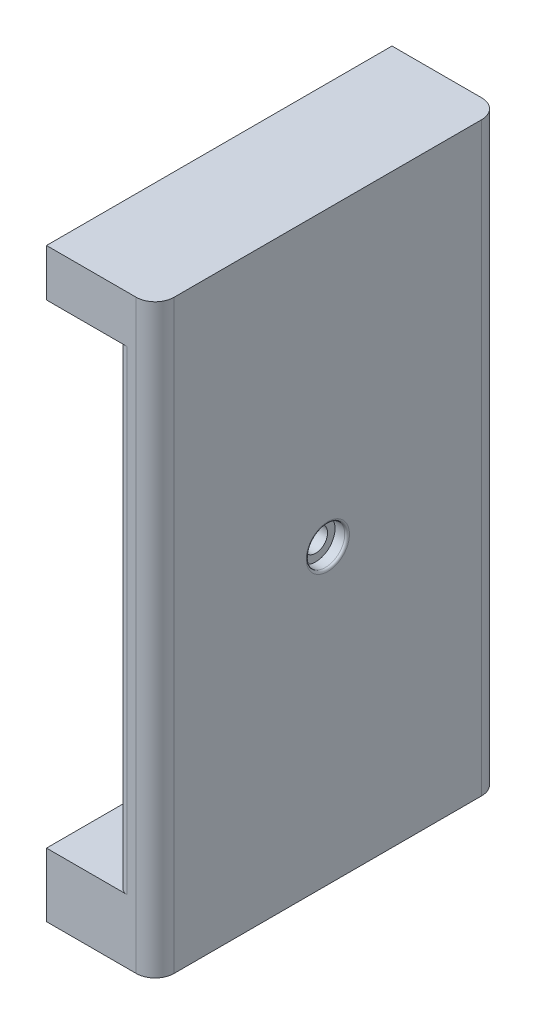
ISO-10303-21;
HEADER;
FILE_DESCRIPTION(('STEP AP214'),'2;1');
FILE_NAME('part.step','',(''),(''),'','','');
FILE_SCHEMA(('AUTOMOTIVE_DESIGN { 1 0 10303 214 1 1 1 1 }'));
ENDSEC;
DATA;
#1=APPLICATION_CONTEXT('core data for automotive mechanical design processes');
#2=APPLICATION_PROTOCOL_DEFINITION('international standard','automotive_design',2000,#1);
#3=PRODUCT_CONTEXT('',#1,'mechanical');
#4=PRODUCT('Part','Part','',(#3));
#5=PRODUCT_RELATED_PRODUCT_CATEGORY('part','',(#4));
#6=PRODUCT_DEFINITION_FORMATION('','',#4);
#7=PRODUCT_DEFINITION_CONTEXT('part definition',#1,'design');
#8=PRODUCT_DEFINITION('design','',#6,#7);
#9=PRODUCT_DEFINITION_SHAPE('','',#8);
#10=(LENGTH_UNIT() NAMED_UNIT(*) SI_UNIT(.MILLI.,.METRE.));
#11=(NAMED_UNIT(*) PLANE_ANGLE_UNIT() SI_UNIT($,.RADIAN.));
#12=(NAMED_UNIT(*) SI_UNIT($,.STERADIAN.) SOLID_ANGLE_UNIT());
#13=UNCERTAINTY_MEASURE_WITH_UNIT(LENGTH_MEASURE(1.E-05),#10,'distance_accuracy_value','');
#14=(GEOMETRIC_REPRESENTATION_CONTEXT(3) GLOBAL_UNCERTAINTY_ASSIGNED_CONTEXT((#13)) GLOBAL_UNIT_ASSIGNED_CONTEXT((#10,
#11,#12)) REPRESENTATION_CONTEXT('',''));
#15=CARTESIAN_POINT('',(0.,0.,0.));
#16=DIRECTION('',(0.,0.,1.));
#17=DIRECTION('',(1.,0.,0.));
#18=AXIS2_PLACEMENT_3D('',#15,#16,#17);
#19=CARTESIAN_POINT('',(20.255,0.,0.));
#20=DIRECTION('',(1.,0.,0.));
#21=DIRECTION('',(0.,1.,0.));
#22=AXIS2_PLACEMENT_3D('',#19,#20,#21);
#23=PLANE('',#22);
#24=CARTESIAN_POINT('',(20.255,0.,0.));
#25=DIRECTION('',(1.,0.,0.));
#26=DIRECTION('',(0.,1.,0.));
#27=AXIS2_PLACEMENT_3D('',#24,#25,#26);
#28=CIRCLE('',#27,20.25);
#29=CARTESIAN_POINT('',(20.255,20.25,0.));
#30=VERTEX_POINT('',#29);
#31=EDGE_CURVE('E226',#30,#30,#28,.T.);
#32=ORIENTED_EDGE('',*,*,#31,.T.);
#33=EDGE_LOOP('',(#32));
#34=FACE_BOUND('',#33,.T.);
#35=DIRECTION('',(0.,0.,1.));
#36=VECTOR('',#35,1.);
#37=CARTESIAN_POINT('',(20.255,52.,-36.576));
#38=LINE('',#37,#36);
#39=CARTESIAN_POINT('',(20.255,52.,-34.576));
#40=VERTEX_POINT('',#39);
#41=CARTESIAN_POINT('',(20.255,52.,34.576));
#42=VERTEX_POINT('',#41);
#43=EDGE_CURVE('E151',#40,#42,#38,.T.);
#44=ORIENTED_EDGE('',*,*,#43,.F.);
#45=DIRECTION('',(0.,1.,0.));
#46=VECTOR('',#45,1.);
#47=CARTESIAN_POINT('',(20.255,0.,-34.576));
#48=LINE('',#47,#46);
#49=CARTESIAN_POINT('',(20.255,-48.5,-34.576));
#50=VERTEX_POINT('',#49);
#51=EDGE_CURVE('E229',#40,#50,#48,.F.);
#52=ORIENTED_EDGE('',*,*,#51,.T.);
#53=DIRECTION('',(0.,0.,-1.));
#54=VECTOR('',#53,1.);
#55=CARTESIAN_POINT('',(20.255,-48.5,-36.576));
#56=LINE('',#55,#54);
#57=CARTESIAN_POINT('',(20.255,-48.5,34.576));
#58=VERTEX_POINT('',#57);
#59=EDGE_CURVE('E157',#58,#50,#56,.T.);
#60=ORIENTED_EDGE('',*,*,#59,.F.);
#61=DIRECTION('',(0.,1.,0.));
#62=VECTOR('',#61,1.);
#63=CARTESIAN_POINT('',(20.255,52.,34.576));
#64=LINE('',#63,#62);
#65=EDGE_CURVE('E223',#58,#42,#64,.T.);
#66=ORIENTED_EDGE('',*,*,#65,.T.);
#67=EDGE_LOOP('',(#44,#52,#60,#66));
#68=FACE_BOUND('',#67,.T.);
#69=ADVANCED_FACE('F45',(#34,#68),#23,.F.);
#70=CARTESIAN_POINT('',(8.25500000000001,0.,0.));
#71=DIRECTION('',(1.,0.,0.));
#72=DIRECTION('',(0.,1.,0.));
#73=AXIS2_PLACEMENT_3D('',#70,#71,#72);
#74=PLANE('',#73);
#75=CARTESIAN_POINT('',(8.25500000000001,0.,0.));
#76=DIRECTION('',(-1.,0.,0.));
#77=DIRECTION('',(0.,-1.,0.));
#78=AXIS2_PLACEMENT_3D('',#75,#76,#77);
#79=CIRCLE('',#78,13.15);
#80=CARTESIAN_POINT('',(8.25500000000001,-13.15,0.));
#81=VERTEX_POINT('',#80);
#82=EDGE_CURVE('E213',#81,#81,#79,.T.);
#83=ORIENTED_EDGE('',*,*,#82,.F.);
#84=EDGE_LOOP('',(#83));
#85=FACE_BOUND('',#84,.T.);
#86=CARTESIAN_POINT('',(8.25500000000001,0.,0.));
#87=DIRECTION('',(-1.,0.,0.));
#88=DIRECTION('',(0.,-1.,0.));
#89=AXIS2_PLACEMENT_3D('',#86,#87,#88);
#90=CIRCLE('',#89,18.25);
#91=CARTESIAN_POINT('',(8.25500000000002,-18.25,0.));
#92=VERTEX_POINT('',#91);
#93=EDGE_CURVE('E217',#92,#92,#90,.T.);
#94=ORIENTED_EDGE('',*,*,#93,.T.);
#95=EDGE_LOOP('',(#94));
#96=FACE_BOUND('',#95,.T.);
#97=ADVANCED_FACE('F335',(#85,#96),#74,.F.);
#98=CARTESIAN_POINT('',(8.255,0.,0.));
#99=DIRECTION('',(-1.,0.,0.));
#100=DIRECTION('',(0.,-1.,0.));
#101=AXIS2_PLACEMENT_3D('',#98,#99,#100);
#102=CYLINDRICAL_SURFACE('',#101,18.25);
#103=CARTESIAN_POINT('',(18.255,0.,0.));
#104=DIRECTION('',(1.,0.,0.));
#105=DIRECTION('',(0.,1.,0.));
#106=AXIS2_PLACEMENT_3D('',#103,#104,#105);
#107=CIRCLE('',#106,18.25);
#108=CARTESIAN_POINT('',(18.255,18.25,0.));
#109=VERTEX_POINT('',#108);
#110=EDGE_CURVE('E231',#109,#109,#107,.F.);
#111=ORIENTED_EDGE('',*,*,#110,.T.);
#112=EDGE_LOOP('',(#111));
#113=FACE_BOUND('',#112,.T.);
#114=ORIENTED_EDGE('',*,*,#93,.F.);
#115=EDGE_LOOP('',(#114));
#116=FACE_BOUND('',#115,.T.);
#117=ADVANCED_FACE('F342',(#113,#116),#102,.T.);
#118=CARTESIAN_POINT('',(20.255,0.,0.));
#119=DIRECTION('',(-1.,0.,0.));
#120=DIRECTION('',(0.,-1.,0.));
#121=AXIS2_PLACEMENT_3D('',#118,#119,#120);
#122=CYLINDRICAL_SURFACE('',#121,13.15);
#123=CARTESIAN_POINT('',(20.255,0.,0.));
#124=DIRECTION('',(-1.,0.,0.));
#125=DIRECTION('',(0.,-1.,0.));
#126=AXIS2_PLACEMENT_3D('',#123,#124,#125);
#127=CIRCLE('',#126,13.15);
#128=CARTESIAN_POINT('',(20.255,-13.15,0.));
#129=VERTEX_POINT('',#128);
#130=EDGE_CURVE('E214',#129,#129,#127,.T.);
#131=ORIENTED_EDGE('',*,*,#130,.F.);
#132=EDGE_LOOP('',(#131));
#133=FACE_BOUND('',#132,.T.);
#134=ORIENTED_EDGE('',*,*,#82,.T.);
#135=EDGE_LOOP('',(#134));
#136=FACE_BOUND('',#135,.T.);
#137=ADVANCED_FACE('F348',(#133,#136),#122,.F.);
#138=CARTESIAN_POINT('',(20.255,0.,0.));
#139=DIRECTION('',(1.,0.,0.));
#140=DIRECTION('',(0.,1.,0.));
#141=AXIS2_PLACEMENT_3D('',#138,#139,#140);
#142=CIRCLE('',#141,2.5);
#143=CARTESIAN_POINT('',(20.255,2.50000000000001,0.));
#144=VERTEX_POINT('',#143);
#145=EDGE_CURVE('E207',#144,#144,#142,.F.);
#146=ORIENTED_EDGE('',*,*,#145,.F.);
#147=EDGE_LOOP('',(#146));
#148=FACE_BOUND('',#147,.T.);
#149=ORIENTED_EDGE('',*,*,#130,.T.);
#150=EDGE_LOOP('',(#149));
#151=FACE_BOUND('',#150,.T.);
#152=ADVANCED_FACE('F338',(#148,#151),#23,.F.);
#153=CARTESIAN_POINT('',(28.255,0.,36.576));
#154=DIRECTION('',(0.,0.,1.));
#155=DIRECTION('',(1.,0.,0.));
#156=AXIS2_PLACEMENT_3D('',#153,#154,#155);
#157=PLANE('',#156);
#158=DIRECTION('',(1.,0.,0.));
#159=VECTOR('',#158,1.);
#160=CARTESIAN_POINT('',(5.25499999999997,52.,36.576));
#161=LINE('',#160,#159);
#162=CARTESIAN_POINT('',(5.25499999999997,52.,36.576));
#163=VERTEX_POINT('',#162);
#164=CARTESIAN_POINT('',(22.255,52.,36.576));
#165=VERTEX_POINT('',#164);
#166=EDGE_CURVE('E60',#163,#165,#161,.T.);
#167=ORIENTED_EDGE('',*,*,#166,.T.);
#168=DIRECTION('',(0.,1.,0.));
#169=VECTOR('',#168,1.);
#170=CARTESIAN_POINT('',(22.255,-48.5,36.576));
#171=LINE('',#170,#169);
#172=CARTESIAN_POINT('',(22.255,-48.5,36.576));
#173=VERTEX_POINT('',#172);
#174=EDGE_CURVE('E234',#165,#173,#171,.F.);
#175=ORIENTED_EDGE('',*,*,#174,.T.);
#176=DIRECTION('',(1.,0.,0.));
#177=VECTOR('',#176,1.);
#178=CARTESIAN_POINT('',(5.25500000000004,-48.5,36.576));
#179=LINE('',#178,#177);
#180=CARTESIAN_POINT('',(5.25500000000004,-48.5,36.576));
#181=VERTEX_POINT('',#180);
#182=EDGE_CURVE('E67',#181,#173,#179,.T.);
#183=ORIENTED_EDGE('',*,*,#182,.F.);
#184=DIRECTION('',(0.,1.,0.));
#185=VECTOR('',#184,1.);
#186=CARTESIAN_POINT('',(5.25500000000004,-48.5,36.576));
#187=LINE('',#186,#185);
#188=CARTESIAN_POINT('',(5.25500000000005,-62.,36.576));
#189=VERTEX_POINT('',#188);
#190=EDGE_CURVE('E171',#189,#181,#187,.T.);
#191=ORIENTED_EDGE('',*,*,#190,.F.);
#192=DIRECTION('',(-1.,0.,0.));
#193=VECTOR('',#192,1.);
#194=CARTESIAN_POINT('',(28.255,-62.,36.576));
#195=LINE('',#194,#193);
#196=CARTESIAN_POINT('',(24.255,-62.,36.576));
#197=VERTEX_POINT('',#196);
#198=EDGE_CURVE('E180',#197,#189,#195,.T.);
#199=ORIENTED_EDGE('',*,*,#198,.F.);
#200=DIRECTION('',(0.,1.,0.));
#201=VECTOR('',#200,1.);
#202=CARTESIAN_POINT('',(24.255,0.,36.576));
#203=LINE('',#202,#201);
#204=CARTESIAN_POINT('',(24.255,62.,36.576));
#205=VERTEX_POINT('',#204);
#206=EDGE_CURVE('E184',#197,#205,#203,.T.);
#207=ORIENTED_EDGE('',*,*,#206,.T.);
#208=DIRECTION('',(-1.,0.,0.));
#209=VECTOR('',#208,1.);
#210=CARTESIAN_POINT('',(28.255,62.,36.576));
#211=LINE('',#210,#209);
#212=CARTESIAN_POINT('',(5.25499999999996,62.,36.576));
#213=VERTEX_POINT('',#212);
#214=EDGE_CURVE('E267',#205,#213,#211,.T.);
#215=ORIENTED_EDGE('',*,*,#214,.T.);
#216=DIRECTION('',(0.,1.,0.));
#217=VECTOR('',#216,1.);
#218=CARTESIAN_POINT('',(5.25499999999996,62.,36.576));
#219=LINE('',#218,#217);
#220=EDGE_CURVE('E141',#163,#213,#219,.T.);
#221=ORIENTED_EDGE('',*,*,#220,.F.);
#222=EDGE_LOOP('',(#167,#175,#183,#191,#199,#207,#215,#221));
#223=FACE_BOUND('',#222,.T.);
#224=ADVANCED_FACE('F246',(#223),#157,.T.);
#225=CARTESIAN_POINT('',(28.255,-62.,0.));
#226=DIRECTION('',(0.,-1.,0.));
#227=DIRECTION('',(1.,0.,0.));
#228=AXIS2_PLACEMENT_3D('',#225,#226,#227);
#229=PLANE('',#228);
#230=CARTESIAN_POINT('',(18.5200000000001,-62.,12.75));
#231=DIRECTION('',(0.,-1.,0.));
#232=DIRECTION('',(1.,0.,0.));
#233=AXIS2_PLACEMENT_3D('',#230,#231,#232);
#234=CIRCLE('',#233,3.71375);
#235=CARTESIAN_POINT('',(22.2337500000001,-62.,12.75));
#236=VERTEX_POINT('',#235);
#237=EDGE_CURVE('E298',#236,#236,#234,.T.);
#238=ORIENTED_EDGE('',*,*,#237,.F.);
#239=EDGE_LOOP('',(#238));
#240=FACE_BOUND('',#239,.T.);
#241=CARTESIAN_POINT('',(18.5200000000001,-62.,-12.75));
#242=DIRECTION('',(0.,-1.,0.));
#243=DIRECTION('',(1.,0.,0.));
#244=AXIS2_PLACEMENT_3D('',#241,#242,#243);
#245=CIRCLE('',#244,3.71375);
#246=CARTESIAN_POINT('',(22.2337500000001,-62.,-12.75));
#247=VERTEX_POINT('',#246);
#248=EDGE_CURVE('E304',#247,#247,#245,.T.);
#249=ORIENTED_EDGE('',*,*,#248,.F.);
#250=EDGE_LOOP('',(#249));
#251=FACE_BOUND('',#250,.T.);
#252=DIRECTION('',(0.,0.,1.));
#253=VECTOR('',#252,1.);
#254=CARTESIAN_POINT('',(28.255,-62.,0.));
#255=LINE('',#254,#253);
#256=CARTESIAN_POINT('',(28.255,-62.,-32.576));
#257=VERTEX_POINT('',#256);
#258=CARTESIAN_POINT('',(28.255,-62.,32.5760000000001));
#259=VERTEX_POINT('',#258);
#260=EDGE_CURVE('E262',#257,#259,#255,.T.);
#261=ORIENTED_EDGE('',*,*,#260,.T.);
#262=CARTESIAN_POINT('',(24.255,-62.,32.5760000000001));
#263=DIRECTION('',(0.,-1.,0.));
#264=DIRECTION('',(1.,0.,0.));
#265=AXIS2_PLACEMENT_3D('',#262,#263,#264);
#266=CIRCLE('',#265,4.);
#267=EDGE_CURVE('E198',#259,#197,#266,.T.);
#268=ORIENTED_EDGE('',*,*,#267,.T.);
#269=ORIENTED_EDGE('',*,*,#198,.T.);
#270=DIRECTION('',(0.,0.,1.));
#271=VECTOR('',#270,1.);
#272=CARTESIAN_POINT('',(5.25500000000005,-62.,-36.576));
#273=LINE('',#272,#271);
#274=CARTESIAN_POINT('',(5.25500000000005,-62.,-36.576));
#275=VERTEX_POINT('',#274);
#276=EDGE_CURVE('E167',#275,#189,#273,.T.);
#277=ORIENTED_EDGE('',*,*,#276,.F.);
#278=DIRECTION('',(-1.,0.,0.));
#279=VECTOR('',#278,1.);
#280=CARTESIAN_POINT('',(28.255,-62.,-36.576));
#281=LINE('',#280,#279);
#282=CARTESIAN_POINT('',(24.255,-62.,-36.576));
#283=VERTEX_POINT('',#282);
#284=EDGE_CURVE('E176',#283,#275,#281,.T.);
#285=ORIENTED_EDGE('',*,*,#284,.F.);
#286=CARTESIAN_POINT('',(24.255,-62.,-32.576));
#287=DIRECTION('',(0.,-1.,0.));
#288=DIRECTION('',(1.,0.,0.));
#289=AXIS2_PLACEMENT_3D('',#286,#287,#288);
#290=CIRCLE('',#289,4.);
#291=EDGE_CURVE('E196',#283,#257,#290,.T.);
#292=ORIENTED_EDGE('',*,*,#291,.T.);
#293=EDGE_LOOP('',(#261,#268,#269,#277,#285,#292));
#294=FACE_BOUND('',#293,.T.);
#295=ADVANCED_FACE('F280',(#240,#251,#294),#229,.T.);
#296=CARTESIAN_POINT('',(28.255,0.,-36.576));
#297=DIRECTION('',(0.,0.,1.));
#298=DIRECTION('',(1.,0.,0.));
#299=AXIS2_PLACEMENT_3D('',#296,#297,#298);
#300=PLANE('',#299);
#301=DIRECTION('',(0.,1.,0.));
#302=VECTOR('',#301,1.);
#303=CARTESIAN_POINT('',(22.255,0.,-36.576));
#304=LINE('',#303,#302);
#305=CARTESIAN_POINT('',(22.255,-48.5,-36.576));
#306=VERTEX_POINT('',#305);
#307=CARTESIAN_POINT('',(22.255,52.,-36.576));
#308=VERTEX_POINT('',#307);
#309=EDGE_CURVE('E156',#306,#308,#304,.T.);
#310=ORIENTED_EDGE('',*,*,#309,.T.);
#311=DIRECTION('',(1.,0.,0.));
#312=VECTOR('',#311,1.);
#313=CARTESIAN_POINT('',(5.25499999999997,52.,-36.576));
#314=LINE('',#313,#312);
#315=CARTESIAN_POINT('',(5.25499999999997,52.,-36.576));
#316=VERTEX_POINT('',#315);
#317=EDGE_CURVE('E137',#316,#308,#314,.T.);
#318=ORIENTED_EDGE('',*,*,#317,.F.);
#319=DIRECTION('',(0.,-1.,0.));
#320=VECTOR('',#319,1.);
#321=CARTESIAN_POINT('',(5.25499999999996,62.,-36.576));
#322=LINE('',#321,#320);
#323=CARTESIAN_POINT('',(5.25499999999996,62.,-36.576));
#324=VERTEX_POINT('',#323);
#325=EDGE_CURVE('E142',#324,#316,#322,.T.);
#326=ORIENTED_EDGE('',*,*,#325,.F.);
#327=DIRECTION('',(-1.,0.,0.));
#328=VECTOR('',#327,1.);
#329=CARTESIAN_POINT('',(28.255,62.,-36.576));
#330=LINE('',#329,#328);
#331=CARTESIAN_POINT('',(24.255,62.,-36.576));
#332=VERTEX_POINT('',#331);
#333=EDGE_CURVE('E181',#332,#324,#330,.T.);
#334=ORIENTED_EDGE('',*,*,#333,.F.);
#335=DIRECTION('',(0.,1.,0.));
#336=VECTOR('',#335,1.);
#337=CARTESIAN_POINT('',(24.255,-62.,-36.576));
#338=LINE('',#337,#336);
#339=EDGE_CURVE('E200',#332,#283,#338,.F.);
#340=ORIENTED_EDGE('',*,*,#339,.T.);
#341=ORIENTED_EDGE('',*,*,#284,.T.);
#342=DIRECTION('',(0.,-1.,0.));
#343=VECTOR('',#342,1.);
#344=CARTESIAN_POINT('',(5.25500000000004,-48.5,-36.576));
#345=LINE('',#344,#343);
#346=CARTESIAN_POINT('',(5.25500000000004,-48.5,-36.576));
#347=VERTEX_POINT('',#346);
#348=EDGE_CURVE('E160',#347,#275,#345,.T.);
#349=ORIENTED_EDGE('',*,*,#348,.F.);
#350=DIRECTION('',(1.,0.,0.));
#351=VECTOR('',#350,1.);
#352=CARTESIAN_POINT('',(5.25500000000004,-48.5,-36.576));
#353=LINE('',#352,#351);
#354=EDGE_CURVE('E249',#347,#306,#353,.T.);
#355=ORIENTED_EDGE('',*,*,#354,.T.);
#356=EDGE_LOOP('',(#310,#318,#326,#334,#340,#341,#349,#355));
#357=FACE_BOUND('',#356,.T.);
#358=ADVANCED_FACE('F154',(#357),#300,.F.);
#359=CARTESIAN_POINT('',(28.255,62.,0.));
#360=DIRECTION('',(0.,-1.,0.));
#361=DIRECTION('',(1.,0.,0.));
#362=AXIS2_PLACEMENT_3D('',#359,#360,#361);
#363=PLANE('',#362);
#364=ORIENTED_EDGE('',*,*,#214,.F.);
#365=CARTESIAN_POINT('',(24.255,62.,32.5760000000001));
#366=DIRECTION('',(0.,-1.,0.));
#367=DIRECTION('',(1.,0.,0.));
#368=AXIS2_PLACEMENT_3D('',#365,#366,#367);
#369=CIRCLE('',#368,4.);
#370=CARTESIAN_POINT('',(28.255,62.,32.5760000000001));
#371=VERTEX_POINT('',#370);
#372=EDGE_CURVE('E189',#205,#371,#369,.F.);
#373=ORIENTED_EDGE('',*,*,#372,.T.);
#374=DIRECTION('',(0.,0.,1.));
#375=VECTOR('',#374,1.);
#376=CARTESIAN_POINT('',(28.255,62.,0.));
#377=LINE('',#376,#375);
#378=CARTESIAN_POINT('',(28.255,62.,-32.576));
#379=VERTEX_POINT('',#378);
#380=EDGE_CURVE('E265',#379,#371,#377,.T.);
#381=ORIENTED_EDGE('',*,*,#380,.F.);
#382=CARTESIAN_POINT('',(24.255,62.,-32.576));
#383=DIRECTION('',(0.,-1.,0.));
#384=DIRECTION('',(1.,0.,0.));
#385=AXIS2_PLACEMENT_3D('',#382,#383,#384);
#386=CIRCLE('',#385,4.);
#387=EDGE_CURVE('E187',#379,#332,#386,.F.);
#388=ORIENTED_EDGE('',*,*,#387,.T.);
#389=ORIENTED_EDGE('',*,*,#333,.T.);
#390=DIRECTION('',(0.,0.,-1.));
#391=VECTOR('',#390,1.);
#392=CARTESIAN_POINT('',(5.25499999999996,62.,-36.576));
#393=LINE('',#392,#391);
#394=EDGE_CURVE('E148',#213,#324,#393,.T.);
#395=ORIENTED_EDGE('',*,*,#394,.F.);
#396=EDGE_LOOP('',(#364,#373,#381,#388,#389,#395));
#397=FACE_BOUND('',#396,.T.);
#398=ADVANCED_FACE('F270',(#397),#363,.F.);
#399=CARTESIAN_POINT('',(28.255,0.,0.));
#400=DIRECTION('',(1.,0.,0.));
#401=DIRECTION('',(0.,1.,0.));
#402=AXIS2_PLACEMENT_3D('',#399,#400,#401);
#403=PLANE('',#402);
#404=CARTESIAN_POINT('',(28.255,0.,0.));
#405=DIRECTION('',(1.,0.,0.));
#406=DIRECTION('',(0.,1.,0.));
#407=AXIS2_PLACEMENT_3D('',#404,#405,#406);
#408=CIRCLE('',#407,4.575);
#409=CARTESIAN_POINT('',(28.255,4.57500000000002,0.));
#410=VERTEX_POINT('',#409);
#411=EDGE_CURVE('E210',#410,#410,#408,.F.);
#412=ORIENTED_EDGE('',*,*,#411,.T.);
#413=EDGE_LOOP('',(#412));
#414=FACE_BOUND('',#413,.T.);
#415=ORIENTED_EDGE('',*,*,#380,.T.);
#416=DIRECTION('',(0.,1.,0.));
#417=VECTOR('',#416,1.);
#418=CARTESIAN_POINT('',(28.255,0.,32.5760000000001));
#419=LINE('',#418,#417);
#420=EDGE_CURVE('E194',#371,#259,#419,.F.);
#421=ORIENTED_EDGE('',*,*,#420,.T.);
#422=ORIENTED_EDGE('',*,*,#260,.F.);
#423=DIRECTION('',(0.,1.,0.));
#424=VECTOR('',#423,1.);
#425=CARTESIAN_POINT('',(28.255,62.,-32.576));
#426=LINE('',#425,#424);
#427=EDGE_CURVE('E191',#257,#379,#426,.T.);
#428=ORIENTED_EDGE('',*,*,#427,.T.);
#429=EDGE_LOOP('',(#415,#421,#422,#428));
#430=FACE_BOUND('',#429,.T.);
#431=ADVANCED_FACE('F284',(#414,#430),#403,.T.);
#432=CARTESIAN_POINT('',(24.255,0.,32.5760000000001));
#433=DIRECTION('',(0.,1.,0.));
#434=DIRECTION('',(-1.,0.,0.));
#435=AXIS2_PLACEMENT_3D('',#432,#433,#434);
#436=CYLINDRICAL_SURFACE('',#435,4.);
#437=ORIENTED_EDGE('',*,*,#267,.F.);
#438=ORIENTED_EDGE('',*,*,#420,.F.);
#439=ORIENTED_EDGE('',*,*,#372,.F.);
#440=ORIENTED_EDGE('',*,*,#206,.F.);
#441=EDGE_LOOP('',(#437,#438,#439,#440));
#442=FACE_BOUND('',#441,.T.);
#443=ADVANCED_FACE('F287',(#442),#436,.T.);
#444=CARTESIAN_POINT('',(24.255,0.,-32.576));
#445=DIRECTION('',(0.,-1.,0.));
#446=DIRECTION('',(1.,0.,0.));
#447=AXIS2_PLACEMENT_3D('',#444,#445,#446);
#448=CYLINDRICAL_SURFACE('',#447,4.);
#449=ORIENTED_EDGE('',*,*,#291,.F.);
#450=ORIENTED_EDGE('',*,*,#339,.F.);
#451=ORIENTED_EDGE('',*,*,#387,.F.);
#452=ORIENTED_EDGE('',*,*,#427,.F.);
#453=EDGE_LOOP('',(#449,#450,#451,#452));
#454=FACE_BOUND('',#453,.T.);
#455=ADVANCED_FACE('F276',(#454),#448,.T.);
#456=CARTESIAN_POINT('',(25.695,0.,0.));
#457=DIRECTION('',(1.,0.,0.));
#458=DIRECTION('',(0.,1.,0.));
#459=AXIS2_PLACEMENT_3D('',#456,#457,#458);
#460=CYLINDRICAL_SURFACE('',#459,4.075);
#461=CARTESIAN_POINT('',(27.755,0.,0.));
#462=DIRECTION('',(1.,0.,0.));
#463=DIRECTION('',(0.,1.,0.));
#464=AXIS2_PLACEMENT_3D('',#461,#462,#463);
#465=CIRCLE('',#464,4.075);
#466=CARTESIAN_POINT('',(27.755,4.07500000000002,0.));
#467=VERTEX_POINT('',#466);
#468=EDGE_CURVE('E202',#467,#467,#465,.T.);
#469=ORIENTED_EDGE('',*,*,#468,.T.);
#470=EDGE_LOOP('',(#469));
#471=FACE_BOUND('',#470,.T.);
#472=CARTESIAN_POINT('',(25.695,0.,0.));
#473=DIRECTION('',(1.,0.,0.));
#474=DIRECTION('',(0.,1.,0.));
#475=AXIS2_PLACEMENT_3D('',#472,#473,#474);
#476=CIRCLE('',#475,4.075);
#477=CARTESIAN_POINT('',(25.695,4.07500000000002,0.));
#478=VERTEX_POINT('',#477);
#479=EDGE_CURVE('E206',#478,#478,#476,.T.);
#480=ORIENTED_EDGE('',*,*,#479,.F.);
#481=EDGE_LOOP('',(#480));
#482=FACE_BOUND('',#481,.T.);
#483=ADVANCED_FACE('F462',(#471,#482),#460,.F.);
#484=CARTESIAN_POINT('',(25.695,0.,0.));
#485=DIRECTION('',(1.,0.,0.));
#486=DIRECTION('',(0.,1.,0.));
#487=AXIS2_PLACEMENT_3D('',#484,#485,#486);
#488=PLANE('',#487);
#489=CARTESIAN_POINT('',(25.695,0.,0.));
#490=DIRECTION('',(1.,0.,0.));
#491=DIRECTION('',(0.,1.,0.));
#492=AXIS2_PLACEMENT_3D('',#489,#490,#491);
#493=CIRCLE('',#492,2.5);
#494=CARTESIAN_POINT('',(25.695,2.50000000000002,0.));
#495=VERTEX_POINT('',#494);
#496=EDGE_CURVE('E203',#495,#495,#493,.T.);
#497=ORIENTED_EDGE('',*,*,#496,.F.);
#498=EDGE_LOOP('',(#497));
#499=FACE_BOUND('',#498,.T.);
#500=ORIENTED_EDGE('',*,*,#479,.T.);
#501=EDGE_LOOP('',(#500));
#502=FACE_BOUND('',#501,.T.);
#503=ADVANCED_FACE('F468',(#499,#502),#488,.T.);
#504=CARTESIAN_POINT('',(13.1839321881345,0.,0.));
#505=DIRECTION('',(1.,0.,0.));
#506=DIRECTION('',(0.,1.,0.));
#507=AXIS2_PLACEMENT_3D('',#504,#505,#506);
#508=CYLINDRICAL_SURFACE('',#507,2.5);
#509=ORIENTED_EDGE('',*,*,#496,.T.);
#510=EDGE_LOOP('',(#509));
#511=FACE_BOUND('',#510,.T.);
#512=ORIENTED_EDGE('',*,*,#145,.T.);
#513=EDGE_LOOP('',(#512));
#514=FACE_BOUND('',#513,.T.);
#515=ADVANCED_FACE('F475',(#511,#514),#508,.F.);
#516=CARTESIAN_POINT('',(27.755,0.,0.));
#517=DIRECTION('',(1.,0.,0.));
#518=DIRECTION('',(0.,1.,0.));
#519=AXIS2_PLACEMENT_3D('',#516,#517,#518);
#520=TOROIDAL_SURFACE('',#519,4.575,0.5);
#521=ORIENTED_EDGE('',*,*,#411,.F.);
#522=EDGE_LOOP('',(#521));
#523=FACE_BOUND('',#522,.T.);
#524=ORIENTED_EDGE('',*,*,#468,.F.);
#525=EDGE_LOOP('',(#524));
#526=FACE_BOUND('',#525,.T.);
#527=ADVANCED_FACE('F482',(#523,#526),#520,.T.);
#528=CARTESIAN_POINT('',(5.25500000000004,-48.5,-36.576));
#529=DIRECTION('',(0.,-1.,0.));
#530=DIRECTION('',(1.,0.,0.));
#531=AXIS2_PLACEMENT_3D('',#528,#529,#530);
#532=PLANE('',#531);
#533=ORIENTED_EDGE('',*,*,#182,.T.);
#534=CARTESIAN_POINT('',(22.255,-48.5,34.576));
#535=DIRECTION('',(0.,-1.,0.));
#536=DIRECTION('',(1.,0.,0.));
#537=AXIS2_PLACEMENT_3D('',#534,#535,#536);
#538=CIRCLE('',#537,2.);
#539=EDGE_CURVE('E12',#173,#58,#538,.T.);
#540=ORIENTED_EDGE('',*,*,#539,.T.);
#541=ORIENTED_EDGE('',*,*,#59,.T.);
#542=CARTESIAN_POINT('',(22.255,-48.5,-34.576));
#543=DIRECTION('',(0.,-1.,0.));
#544=DIRECTION('',(1.,0.,0.));
#545=AXIS2_PLACEMENT_3D('',#542,#543,#544);
#546=CIRCLE('',#545,2.);
#547=EDGE_CURVE('E238',#50,#306,#546,.T.);
#548=ORIENTED_EDGE('',*,*,#547,.T.);
#549=ORIENTED_EDGE('',*,*,#354,.F.);
#550=DIRECTION('',(0.,0.,-1.));
#551=VECTOR('',#550,1.);
#552=CARTESIAN_POINT('',(5.25500000000004,-48.5,-36.576));
#553=LINE('',#552,#551);
#554=EDGE_CURVE('E252',#181,#347,#553,.T.);
#555=ORIENTED_EDGE('',*,*,#554,.F.);
#556=EDGE_LOOP('',(#533,#540,#541,#548,#549,#555));
#557=FACE_BOUND('',#556,.T.);
#558=ADVANCED_FACE('F253',(#557),#532,.F.);
#559=CARTESIAN_POINT('',(5.25500000000002,0.,0.));
#560=DIRECTION('',(-1.,0.,0.));
#561=DIRECTION('',(0.,-1.,0.));
#562=AXIS2_PLACEMENT_3D('',#559,#560,#561);
#563=PLANE('',#562);
#564=ORIENTED_EDGE('',*,*,#348,.T.);
#565=ORIENTED_EDGE('',*,*,#276,.T.);
#566=ORIENTED_EDGE('',*,*,#190,.T.);
#567=ORIENTED_EDGE('',*,*,#554,.T.);
#568=EDGE_LOOP('',(#564,#565,#566,#567));
#569=FACE_BOUND('',#568,.T.);
#570=ADVANCED_FACE('F289',(#569),#563,.T.);
#571=CARTESIAN_POINT('',(5.25499999999997,52.,-36.576));
#572=DIRECTION('',(0.,1.,0.));
#573=DIRECTION('',(-1.,0.,0.));
#574=AXIS2_PLACEMENT_3D('',#571,#572,#573);
#575=PLANE('',#574);
#576=ORIENTED_EDGE('',*,*,#317,.T.);
#577=CARTESIAN_POINT('',(22.255,52.,-34.576));
#578=DIRECTION('',(0.,1.,0.));
#579=DIRECTION('',(-1.,0.,0.));
#580=AXIS2_PLACEMENT_3D('',#577,#578,#579);
#581=CIRCLE('',#580,2.);
#582=EDGE_CURVE('E236',#308,#40,#581,.T.);
#583=ORIENTED_EDGE('',*,*,#582,.T.);
#584=ORIENTED_EDGE('',*,*,#43,.T.);
#585=CARTESIAN_POINT('',(22.255,52.,34.576));
#586=DIRECTION('',(0.,1.,0.));
#587=DIRECTION('',(-1.,0.,0.));
#588=AXIS2_PLACEMENT_3D('',#585,#586,#587);
#589=CIRCLE('',#588,2.);
#590=EDGE_CURVE('E53',#42,#165,#589,.T.);
#591=ORIENTED_EDGE('',*,*,#590,.T.);
#592=ORIENTED_EDGE('',*,*,#166,.F.);
#593=DIRECTION('',(0.,0.,1.));
#594=VECTOR('',#593,1.);
#595=CARTESIAN_POINT('',(5.25499999999997,52.,-36.576));
#596=LINE('',#595,#594);
#597=EDGE_CURVE('E133',#316,#163,#596,.T.);
#598=ORIENTED_EDGE('',*,*,#597,.F.);
#599=EDGE_LOOP('',(#576,#583,#584,#591,#592,#598));
#600=FACE_BOUND('',#599,.T.);
#601=ADVANCED_FACE('F135',(#600),#575,.F.);
#602=CARTESIAN_POINT('',(5.25500000000001,0.,0.));
#603=DIRECTION('',(-1.,0.,0.));
#604=DIRECTION('',(0.,-1.,0.));
#605=AXIS2_PLACEMENT_3D('',#602,#603,#604);
#606=PLANE('',#605);
#607=ORIENTED_EDGE('',*,*,#325,.T.);
#608=ORIENTED_EDGE('',*,*,#597,.T.);
#609=ORIENTED_EDGE('',*,*,#220,.T.);
#610=ORIENTED_EDGE('',*,*,#394,.T.);
#611=EDGE_LOOP('',(#607,#608,#609,#610));
#612=FACE_BOUND('',#611,.T.);
#613=ADVANCED_FACE('F146',(#612),#606,.T.);
#614=CARTESIAN_POINT('',(22.255,0.,-34.576));
#615=DIRECTION('',(0.,1.,0.));
#616=DIRECTION('',(-1.,0.,0.));
#617=AXIS2_PLACEMENT_3D('',#614,#615,#616);
#618=CYLINDRICAL_SURFACE('',#617,2.);
#619=ORIENTED_EDGE('',*,*,#547,.F.);
#620=ORIENTED_EDGE('',*,*,#51,.F.);
#621=ORIENTED_EDGE('',*,*,#582,.F.);
#622=ORIENTED_EDGE('',*,*,#309,.F.);
#623=EDGE_LOOP('',(#619,#620,#621,#622));
#624=FACE_BOUND('',#623,.T.);
#625=ADVANCED_FACE('F294',(#624),#618,.T.);
#626=CARTESIAN_POINT('',(18.255,0.,0.));
#627=DIRECTION('',(1.,0.,0.));
#628=DIRECTION('',(0.,1.,0.));
#629=AXIS2_PLACEMENT_3D('',#626,#627,#628);
#630=TOROIDAL_SURFACE('',#629,20.25,2.);
#631=ORIENTED_EDGE('',*,*,#31,.F.);
#632=EDGE_LOOP('',(#631));
#633=FACE_BOUND('',#632,.T.);
#634=ORIENTED_EDGE('',*,*,#110,.F.);
#635=EDGE_LOOP('',(#634));
#636=FACE_BOUND('',#635,.T.);
#637=ADVANCED_FACE('F331',(#633,#636),#630,.F.);
#638=CARTESIAN_POINT('',(22.255,0.,34.576));
#639=DIRECTION('',(0.,-1.,0.));
#640=DIRECTION('',(1.,0.,0.));
#641=AXIS2_PLACEMENT_3D('',#638,#639,#640);
#642=CYLINDRICAL_SURFACE('',#641,2.);
#643=ORIENTED_EDGE('',*,*,#539,.F.);
#644=ORIENTED_EDGE('',*,*,#174,.F.);
#645=ORIENTED_EDGE('',*,*,#590,.F.);
#646=ORIENTED_EDGE('',*,*,#65,.F.);
#647=EDGE_LOOP('',(#643,#644,#645,#646));
#648=FACE_BOUND('',#647,.T.);
#649=ADVANCED_FACE('F47',(#648),#642,.T.);
#650=CARTESIAN_POINT('',(18.52,-52.5,-12.75));
#651=DIRECTION('',(0.,-1.,0.));
#652=DIRECTION('',(1.,0.,0.));
#653=AXIS2_PLACEMENT_3D('',#650,#651,#652);
#654=CYLINDRICAL_SURFACE('',#653,3.71375);
#655=CARTESIAN_POINT('',(18.52,-52.5,-12.75));
#656=DIRECTION('',(0.,-1.,0.));
#657=DIRECTION('',(1.,0.,0.));
#658=AXIS2_PLACEMENT_3D('',#655,#656,#657);
#659=CIRCLE('',#658,3.71375);
#660=CARTESIAN_POINT('',(22.2337500000001,-52.5,-12.75));
#661=VERTEX_POINT('',#660);
#662=EDGE_CURVE('E307',#661,#661,#659,.T.);
#663=ORIENTED_EDGE('',*,*,#662,.F.);
#664=EDGE_LOOP('',(#663));
#665=FACE_BOUND('',#664,.T.);
#666=ORIENTED_EDGE('',*,*,#248,.T.);
#667=EDGE_LOOP('',(#666));
#668=FACE_BOUND('',#667,.T.);
#669=ADVANCED_FACE('F320',(#665,#668),#654,.F.);
#670=CARTESIAN_POINT('',(18.52,-52.5,-12.75));
#671=DIRECTION('',(0.,-1.,0.));
#672=DIRECTION('',(1.,0.,0.));
#673=AXIS2_PLACEMENT_3D('',#670,#671,#672);
#674=PLANE('',#673);
#675=ORIENTED_EDGE('',*,*,#662,.T.);
#676=EDGE_LOOP('',(#675));
#677=FACE_BOUND('',#676,.T.);
#678=ADVANCED_FACE('F322',(#677),#674,.T.);
#679=CARTESIAN_POINT('',(18.52,-52.5,12.75));
#680=DIRECTION('',(0.,-1.,0.));
#681=DIRECTION('',(1.,0.,0.));
#682=AXIS2_PLACEMENT_3D('',#679,#680,#681);
#683=CYLINDRICAL_SURFACE('',#682,3.71375);
#684=CARTESIAN_POINT('',(18.52,-52.5,12.75));
#685=DIRECTION('',(0.,-1.,0.));
#686=DIRECTION('',(1.,0.,0.));
#687=AXIS2_PLACEMENT_3D('',#684,#685,#686);
#688=CIRCLE('',#687,3.71375);
#689=CARTESIAN_POINT('',(22.2337500000001,-52.5,12.75));
#690=VERTEX_POINT('',#689);
#691=EDGE_CURVE('E296',#690,#690,#688,.T.);
#692=ORIENTED_EDGE('',*,*,#691,.F.);
#693=EDGE_LOOP('',(#692));
#694=FACE_BOUND('',#693,.T.);
#695=ORIENTED_EDGE('',*,*,#237,.T.);
#696=EDGE_LOOP('',(#695));
#697=FACE_BOUND('',#696,.T.);
#698=ADVANCED_FACE('F313',(#694,#697),#683,.F.);
#699=CARTESIAN_POINT('',(18.52,-52.5,12.75));
#700=DIRECTION('',(0.,-1.,0.));
#701=DIRECTION('',(1.,0.,0.));
#702=AXIS2_PLACEMENT_3D('',#699,#700,#701);
#703=PLANE('',#702);
#704=ORIENTED_EDGE('',*,*,#691,.T.);
#705=EDGE_LOOP('',(#704));
#706=FACE_BOUND('',#705,.T.);
#707=ADVANCED_FACE('F416',(#706),#703,.T.);
#708=CLOSED_SHELL('',(#69,#97,#117,#137,#152,#224,#295,#358,#398,#431,#443,#455,#483,#503,#515,
#527,#558,#570,#601,#613,#625,#637,#649,#669,#678,#698,#707));
#709=MANIFOLD_SOLID_BREP('B2',#708);
#710=ADVANCED_BREP_SHAPE_REPRESENTATION('',(#18,#709),#14);
#711=SHAPE_DEFINITION_REPRESENTATION(#9,#710);
ENDSEC;
END-ISO-10303-21;
